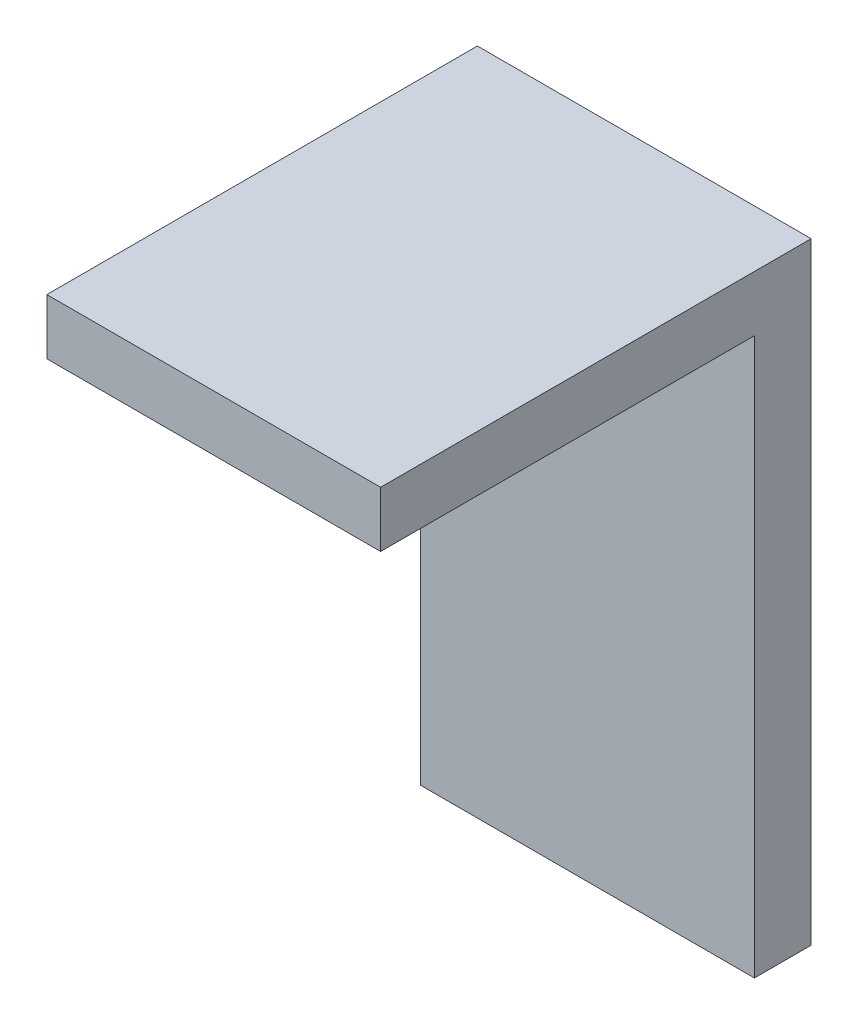
ISO-10303-21;
HEADER;
FILE_DESCRIPTION(('STEP AP214'),'2;1');
FILE_NAME('part.step','',(''),(''),'','','');
FILE_SCHEMA(('AUTOMOTIVE_DESIGN { 1 0 10303 214 1 1 1 1 }'));
ENDSEC;
DATA;
#1=APPLICATION_CONTEXT('core data for automotive mechanical design processes');
#2=APPLICATION_PROTOCOL_DEFINITION('international standard','automotive_design',2000,#1);
#3=PRODUCT_CONTEXT('',#1,'mechanical');
#4=PRODUCT('Part','Part','',(#3));
#5=PRODUCT_RELATED_PRODUCT_CATEGORY('part','',(#4));
#6=PRODUCT_DEFINITION_FORMATION('','',#4);
#7=PRODUCT_DEFINITION_CONTEXT('part definition',#1,'design');
#8=PRODUCT_DEFINITION('design','',#6,#7);
#9=PRODUCT_DEFINITION_SHAPE('','',#8);
#10=(LENGTH_UNIT() NAMED_UNIT(*) SI_UNIT(.MILLI.,.METRE.));
#11=(NAMED_UNIT(*) PLANE_ANGLE_UNIT() SI_UNIT($,.RADIAN.));
#12=(NAMED_UNIT(*) SI_UNIT($,.STERADIAN.) SOLID_ANGLE_UNIT());
#13=UNCERTAINTY_MEASURE_WITH_UNIT(LENGTH_MEASURE(1.E-05),#10,'distance_accuracy_value','');
#14=(GEOMETRIC_REPRESENTATION_CONTEXT(3) GLOBAL_UNCERTAINTY_ASSIGNED_CONTEXT((#13)) GLOBAL_UNIT_ASSIGNED_CONTEXT((#10,
#11,#12)) REPRESENTATION_CONTEXT('',''));
#15=CARTESIAN_POINT('',(0.,0.,0.));
#16=DIRECTION('',(0.,0.,1.));
#17=DIRECTION('',(1.,0.,0.));
#18=AXIS2_PLACEMENT_3D('',#15,#16,#17);
#19=CARTESIAN_POINT('',(0.6,4.55,0.));
#20=DIRECTION('',(-1.,0.,0.));
#21=DIRECTION('',(0.,0.,1.));
#22=AXIS2_PLACEMENT_3D('',#19,#20,#21);
#23=PLANE('',#22);
#24=DIRECTION('',(0.,1.,0.));
#25=VECTOR('',#24,1.);
#26=CARTESIAN_POINT('',(0.6,4.,0.));
#27=LINE('',#26,#25);
#28=CARTESIAN_POINT('',(0.6,4.,0.));
#29=VERTEX_POINT('',#28);
#30=CARTESIAN_POINT('',(0.6,4.55,0.));
#31=VERTEX_POINT('',#30);
#32=EDGE_CURVE('E11',#29,#31,#27,.T.);
#33=ORIENTED_EDGE('',*,*,#32,.F.);
#34=DIRECTION('',(0.,0.,-1.));
#35=VECTOR('',#34,1.);
#36=CARTESIAN_POINT('',(0.6,4.,0.051));
#37=LINE('',#36,#35);
#38=CARTESIAN_POINT('',(0.6,4.,0.051));
#39=VERTEX_POINT('',#38);
#40=EDGE_CURVE('E24',#39,#29,#37,.T.);
#41=ORIENTED_EDGE('',*,*,#40,.F.);
#42=DIRECTION('',(0.,-1.,0.));
#43=VECTOR('',#42,1.);
#44=CARTESIAN_POINT('',(0.6,4.5,0.051));
#45=LINE('',#44,#43);
#46=CARTESIAN_POINT('',(0.6,4.5,0.051));
#47=VERTEX_POINT('',#46);
#48=EDGE_CURVE('E87',#47,#39,#45,.T.);
#49=ORIENTED_EDGE('',*,*,#48,.F.);
#50=DIRECTION('',(0.,0.,-1.));
#51=VECTOR('',#50,1.);
#52=CARTESIAN_POINT('',(0.6,4.5,0.387));
#53=LINE('',#52,#51);
#54=CARTESIAN_POINT('',(0.6,4.5,0.387));
#55=VERTEX_POINT('',#54);
#56=EDGE_CURVE('E114',#55,#47,#53,.T.);
#57=ORIENTED_EDGE('',*,*,#56,.F.);
#58=DIRECTION('',(0.,-1.,0.));
#59=VECTOR('',#58,1.);
#60=CARTESIAN_POINT('',(0.6,4.55,0.387));
#61=LINE('',#60,#59);
#62=CARTESIAN_POINT('',(0.6,4.55,0.387));
#63=VERTEX_POINT('',#62);
#64=EDGE_CURVE('E111',#63,#55,#61,.T.);
#65=ORIENTED_EDGE('',*,*,#64,.F.);
#66=DIRECTION('',(0.,0.,1.));
#67=VECTOR('',#66,1.);
#68=CARTESIAN_POINT('',(0.6,4.55,0.));
#69=LINE('',#68,#67);
#70=EDGE_CURVE('E108',#31,#63,#69,.T.);
#71=ORIENTED_EDGE('',*,*,#70,.F.);
#72=EDGE_LOOP('',(#33,#41,#49,#57,#65,#71));
#73=FACE_BOUND('',#72,.T.);
#74=ADVANCED_FACE('F17',(#73),#23,.T.);
#75=CARTESIAN_POINT('',(0.9,4.,0.));
#76=DIRECTION('',(1.,0.,0.));
#77=DIRECTION('',(0.,0.,1.));
#78=AXIS2_PLACEMENT_3D('',#75,#76,#77);
#79=PLANE('',#78);
#80=DIRECTION('',(0.,-1.,0.));
#81=VECTOR('',#80,1.);
#82=CARTESIAN_POINT('',(0.9,4.55,0.));
#83=LINE('',#82,#81);
#84=CARTESIAN_POINT('',(0.9,4.55,0.));
#85=VERTEX_POINT('',#84);
#86=CARTESIAN_POINT('',(0.9,4.,0.));
#87=VERTEX_POINT('',#86);
#88=EDGE_CURVE('E106',#85,#87,#83,.T.);
#89=ORIENTED_EDGE('',*,*,#88,.F.);
#90=DIRECTION('',(0.,0.,-1.));
#91=VECTOR('',#90,1.);
#92=CARTESIAN_POINT('',(0.9,4.55,0.387));
#93=LINE('',#92,#91);
#94=CARTESIAN_POINT('',(0.9,4.55,0.387));
#95=VERTEX_POINT('',#94);
#96=EDGE_CURVE('E103',#95,#85,#93,.T.);
#97=ORIENTED_EDGE('',*,*,#96,.F.);
#98=DIRECTION('',(0.,1.,0.));
#99=VECTOR('',#98,1.);
#100=CARTESIAN_POINT('',(0.9,4.5,0.387));
#101=LINE('',#100,#99);
#102=CARTESIAN_POINT('',(0.9,4.5,0.387));
#103=VERTEX_POINT('',#102);
#104=EDGE_CURVE('E100',#103,#95,#101,.T.);
#105=ORIENTED_EDGE('',*,*,#104,.F.);
#106=DIRECTION('',(0.,0.,1.));
#107=VECTOR('',#106,1.);
#108=CARTESIAN_POINT('',(0.9,4.5,0.051));
#109=LINE('',#108,#107);
#110=CARTESIAN_POINT('',(0.9,4.5,0.051));
#111=VERTEX_POINT('',#110);
#112=EDGE_CURVE('E72',#111,#103,#109,.T.);
#113=ORIENTED_EDGE('',*,*,#112,.F.);
#114=DIRECTION('',(0.,1.,0.));
#115=VECTOR('',#114,1.);
#116=CARTESIAN_POINT('',(0.9,4.,0.051));
#117=LINE('',#116,#115);
#118=CARTESIAN_POINT('',(0.9,4.,0.051));
#119=VERTEX_POINT('',#118);
#120=EDGE_CURVE('E66',#119,#111,#117,.T.);
#121=ORIENTED_EDGE('',*,*,#120,.F.);
#122=DIRECTION('',(0.,0.,1.));
#123=VECTOR('',#122,1.);
#124=CARTESIAN_POINT('',(0.9,4.,0.));
#125=LINE('',#124,#123);
#126=EDGE_CURVE('E69',#87,#119,#125,.T.);
#127=ORIENTED_EDGE('',*,*,#126,.F.);
#128=EDGE_LOOP('',(#89,#97,#105,#113,#121,#127));
#129=FACE_BOUND('',#128,.T.);
#130=ADVANCED_FACE('F68',(#129),#79,.T.);
#131=CARTESIAN_POINT('',(0.6,4.55,0.387));
#132=DIRECTION('',(0.,0.,1.));
#133=DIRECTION('',(0.,1.,0.));
#134=AXIS2_PLACEMENT_3D('',#131,#132,#133);
#135=PLANE('',#134);
#136=ORIENTED_EDGE('',*,*,#64,.T.);
#137=DIRECTION('',(-1.,0.,0.));
#138=VECTOR('',#137,1.);
#139=CARTESIAN_POINT('',(0.9,4.5,0.387));
#140=LINE('',#139,#138);
#141=EDGE_CURVE('E83',#103,#55,#140,.T.);
#142=ORIENTED_EDGE('',*,*,#141,.F.);
#143=ORIENTED_EDGE('',*,*,#104,.T.);
#144=DIRECTION('',(1.,0.,0.));
#145=VECTOR('',#144,1.);
#146=CARTESIAN_POINT('',(0.6,4.55,0.387));
#147=LINE('',#146,#145);
#148=EDGE_CURVE('E88',#63,#95,#147,.T.);
#149=ORIENTED_EDGE('',*,*,#148,.F.);
#150=EDGE_LOOP('',(#136,#142,#143,#149));
#151=FACE_BOUND('',#150,.T.);
#152=ADVANCED_FACE('F125',(#151),#135,.T.);
#153=CARTESIAN_POINT('',(0.6,4.5,0.051));
#154=DIRECTION('',(0.,0.,1.));
#155=DIRECTION('',(0.,1.,0.));
#156=AXIS2_PLACEMENT_3D('',#153,#154,#155);
#157=PLANE('',#156);
#158=ORIENTED_EDGE('',*,*,#48,.T.);
#159=DIRECTION('',(-1.,0.,0.));
#160=VECTOR('',#159,1.);
#161=CARTESIAN_POINT('',(0.9,4.,0.051));
#162=LINE('',#161,#160);
#163=EDGE_CURVE('E81',#119,#39,#162,.T.);
#164=ORIENTED_EDGE('',*,*,#163,.F.);
#165=ORIENTED_EDGE('',*,*,#120,.T.);
#166=DIRECTION('',(1.,0.,0.));
#167=VECTOR('',#166,1.);
#168=CARTESIAN_POINT('',(0.6,4.5,0.051));
#169=LINE('',#168,#167);
#170=EDGE_CURVE('E89',#47,#111,#169,.T.);
#171=ORIENTED_EDGE('',*,*,#170,.F.);
#172=EDGE_LOOP('',(#158,#164,#165,#171));
#173=FACE_BOUND('',#172,.T.);
#174=ADVANCED_FACE('F86',(#173),#157,.T.);
#175=CARTESIAN_POINT('',(0.9,4.55,0.));
#176=DIRECTION('',(0.,1.,0.));
#177=DIRECTION('',(0.,0.,1.));
#178=AXIS2_PLACEMENT_3D('',#175,#176,#177);
#179=PLANE('',#178);
#180=DIRECTION('',(1.,0.,0.));
#181=VECTOR('',#180,1.);
#182=CARTESIAN_POINT('',(0.6,4.55,0.));
#183=LINE('',#182,#181);
#184=EDGE_CURVE('E93',#31,#85,#183,.T.);
#185=ORIENTED_EDGE('',*,*,#184,.F.);
#186=ORIENTED_EDGE('',*,*,#70,.T.);
#187=ORIENTED_EDGE('',*,*,#148,.T.);
#188=ORIENTED_EDGE('',*,*,#96,.T.);
#189=EDGE_LOOP('',(#185,#186,#187,#188));
#190=FACE_BOUND('',#189,.T.);
#191=ADVANCED_FACE('F121',(#190),#179,.T.);
#192=CARTESIAN_POINT('',(0.6,4.,0.));
#193=DIRECTION('',(0.,-1.,0.));
#194=DIRECTION('',(0.,0.,1.));
#195=AXIS2_PLACEMENT_3D('',#192,#193,#194);
#196=PLANE('',#195);
#197=DIRECTION('',(-1.,0.,0.));
#198=VECTOR('',#197,1.);
#199=CARTESIAN_POINT('',(0.9,4.,0.));
#200=LINE('',#199,#198);
#201=EDGE_CURVE('E82',#87,#29,#200,.T.);
#202=ORIENTED_EDGE('',*,*,#201,.F.);
#203=ORIENTED_EDGE('',*,*,#126,.T.);
#204=ORIENTED_EDGE('',*,*,#163,.T.);
#205=ORIENTED_EDGE('',*,*,#40,.T.);
#206=EDGE_LOOP('',(#202,#203,#204,#205));
#207=FACE_BOUND('',#206,.T.);
#208=ADVANCED_FACE('F80',(#207),#196,.T.);
#209=CARTESIAN_POINT('',(0.6,4.5,0.051));
#210=DIRECTION('',(0.,-1.,0.));
#211=DIRECTION('',(0.,0.,1.));
#212=AXIS2_PLACEMENT_3D('',#209,#210,#211);
#213=PLANE('',#212);
#214=ORIENTED_EDGE('',*,*,#170,.T.);
#215=ORIENTED_EDGE('',*,*,#112,.T.);
#216=ORIENTED_EDGE('',*,*,#141,.T.);
#217=ORIENTED_EDGE('',*,*,#56,.T.);
#218=EDGE_LOOP('',(#214,#215,#216,#217));
#219=FACE_BOUND('',#218,.T.);
#220=ADVANCED_FACE('F127',(#219),#213,.T.);
#221=CARTESIAN_POINT('',(0.9,4.55,0.));
#222=DIRECTION('',(0.,0.,-1.));
#223=DIRECTION('',(0.,1.,0.));
#224=AXIS2_PLACEMENT_3D('',#221,#222,#223);
#225=PLANE('',#224);
#226=ORIENTED_EDGE('',*,*,#88,.T.);
#227=ORIENTED_EDGE('',*,*,#201,.T.);
#228=ORIENTED_EDGE('',*,*,#32,.T.);
#229=ORIENTED_EDGE('',*,*,#184,.T.);
#230=EDGE_LOOP('',(#226,#227,#228,#229));
#231=FACE_BOUND('',#230,.T.);
#232=ADVANCED_FACE('F117',(#231),#225,.T.);
#233=CLOSED_SHELL('',(#74,#130,#152,#174,#191,#208,#220,#232));
#234=MANIFOLD_SOLID_BREP('B1',#233);
#235=ADVANCED_BREP_SHAPE_REPRESENTATION('',(#18,#234),#14);
#236=SHAPE_DEFINITION_REPRESENTATION(#9,#235);
ENDSEC;
END-ISO-10303-21;
